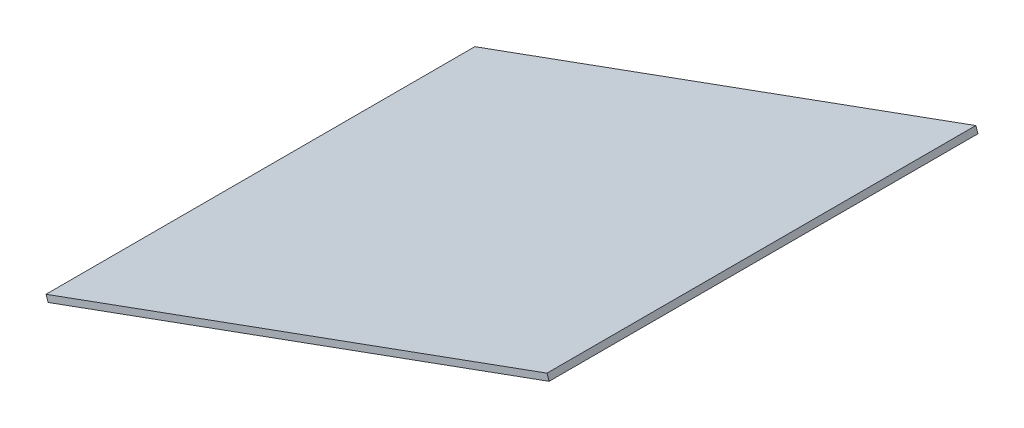
ISO-10303-21;
HEADER;
FILE_DESCRIPTION(('STEP AP214'),'2;1');
FILE_NAME('part.step','',(''),(''),'','','');
FILE_SCHEMA(('AUTOMOTIVE_DESIGN { 1 0 10303 214 1 1 1 1 }'));
ENDSEC;
DATA;
#1=APPLICATION_CONTEXT('core data for automotive mechanical design processes');
#2=APPLICATION_PROTOCOL_DEFINITION('international standard','automotive_design',2000,#1);
#3=PRODUCT_CONTEXT('',#1,'mechanical');
#4=PRODUCT('Part','Part','',(#3));
#5=PRODUCT_RELATED_PRODUCT_CATEGORY('part','',(#4));
#6=PRODUCT_DEFINITION_FORMATION('','',#4);
#7=PRODUCT_DEFINITION_CONTEXT('part definition',#1,'design');
#8=PRODUCT_DEFINITION('design','',#6,#7);
#9=PRODUCT_DEFINITION_SHAPE('','',#8);
#10=(LENGTH_UNIT() NAMED_UNIT(*) SI_UNIT(.MILLI.,.METRE.));
#11=(NAMED_UNIT(*) PLANE_ANGLE_UNIT() SI_UNIT($,.RADIAN.));
#12=(NAMED_UNIT(*) SI_UNIT($,.STERADIAN.) SOLID_ANGLE_UNIT());
#13=UNCERTAINTY_MEASURE_WITH_UNIT(LENGTH_MEASURE(1.E-05),#10,'distance_accuracy_value','');
#14=(GEOMETRIC_REPRESENTATION_CONTEXT(3) GLOBAL_UNCERTAINTY_ASSIGNED_CONTEXT((#13)) GLOBAL_UNIT_ASSIGNED_CONTEXT((#10,
#11,#12)) REPRESENTATION_CONTEXT('',''));
#15=CARTESIAN_POINT('',(0.,0.,0.));
#16=DIRECTION('',(0.,0.,1.));
#17=DIRECTION('',(1.,0.,0.));
#18=AXIS2_PLACEMENT_3D('',#15,#16,#17);
#19=CARTESIAN_POINT('',(9742.34082805623,633.915324322345,454.337600591208));
#20=DIRECTION('',(0.939787101139107,0.341760449046629,0.));
#21=DIRECTION('',(-0.341760449046629,0.939787101139108,0.));
#22=AXIS2_PLACEMENT_3D('',#19,#20,#21);
#23=PLANE('',#22);
#24=DIRECTION('',(0.341760449046629,-0.939787101139107,0.));
#25=VECTOR('',#24,1.);
#26=CARTESIAN_POINT('',(9742.34082805623,633.915324322345,202.799999999994));
#27=LINE('',#26,#25);
#28=CARTESIAN_POINT('',(9742.34082805673,633.915324322537,202.799999999994));
#29=VERTEX_POINT('',#28);
#30=CARTESIAN_POINT('',(9743.36610940387,631.095963019111,202.799999999994));
#31=VERTEX_POINT('',#30);
#32=EDGE_CURVE('E11',#29,#31,#27,.T.);
#33=ORIENTED_EDGE('',*,*,#32,.F.);
#34=DIRECTION('',(0.,0.,-1.));
#35=VECTOR('',#34,1.);
#36=CARTESIAN_POINT('',(9742.34082805623,633.915324322345,454.337600591208));
#37=LINE('',#36,#35);
#38=CARTESIAN_POINT('',(9742.34082805623,633.915324322345,1.9999999999937));
#39=VERTEX_POINT('',#38);
#40=EDGE_CURVE('E91',#29,#39,#37,.T.);
#41=ORIENTED_EDGE('',*,*,#40,.T.);
#42=DIRECTION('',(0.341760449046629,-0.939787101139107,0.));
#43=VECTOR('',#42,1.);
#44=CARTESIAN_POINT('',(9742.34082805623,633.915324322345,1.9999999999937));
#45=LINE('',#44,#43);
#46=CARTESIAN_POINT('',(9743.36610940337,631.095963018928,1.9999999999937));
#47=VERTEX_POINT('',#46);
#48=EDGE_CURVE('E82',#39,#47,#45,.T.);
#49=ORIENTED_EDGE('',*,*,#48,.T.);
#50=DIRECTION('',(0.,0.,-1.));
#51=VECTOR('',#50,1.);
#52=CARTESIAN_POINT('',(9743.36610940337,631.095963018928,454.337600591208));
#53=LINE('',#52,#51);
#54=EDGE_CURVE('E75',#31,#47,#53,.T.);
#55=ORIENTED_EDGE('',*,*,#54,.F.);
#56=EDGE_LOOP('',(#33,#41,#49,#55));
#57=FACE_BOUND('',#56,.T.);
#58=ADVANCED_FACE('F33',(#57),#23,.F.);
#59=CARTESIAN_POINT('',(9743.36610940337,631.095963018928,454.337600591208));
#60=DIRECTION('',(-0.341760449046657,0.939787101139097,0.));
#61=DIRECTION('',(-0.939787101139097,-0.341760449046657,0.));
#62=AXIS2_PLACEMENT_3D('',#59,#60,#61);
#63=PLANE('',#62);
#64=DIRECTION('',(0.939787101139097,0.341760449046657,0.));
#65=VECTOR('',#64,1.);
#66=CARTESIAN_POINT('',(9743.36610940337,631.095963018928,202.799999999994));
#67=LINE('',#66,#65);
#68=CARTESIAN_POINT('',(9977.93696984819,716.399371101157,202.799999999994));
#69=VERTEX_POINT('',#68);
#70=EDGE_CURVE('E37',#31,#69,#67,.T.);
#71=ORIENTED_EDGE('',*,*,#70,.F.);
#72=ORIENTED_EDGE('',*,*,#54,.T.);
#73=DIRECTION('',(0.939787101139097,0.341760449046657,0.));
#74=VECTOR('',#73,1.);
#75=CARTESIAN_POINT('',(9743.36610940337,631.095963018928,1.9999999999937));
#76=LINE('',#75,#74);
#77=CARTESIAN_POINT('',(9977.93696984769,716.399371100974,1.9999999999937));
#78=VERTEX_POINT('',#77);
#79=EDGE_CURVE('E78',#47,#78,#76,.T.);
#80=ORIENTED_EDGE('',*,*,#79,.T.);
#81=DIRECTION('',(0.,0.,-1.));
#82=VECTOR('',#81,1.);
#83=CARTESIAN_POINT('',(9977.93696984769,716.399371100974,454.337600591208));
#84=LINE('',#83,#82);
#85=EDGE_CURVE('E70',#69,#78,#84,.T.);
#86=ORIENTED_EDGE('',*,*,#85,.F.);
#87=EDGE_LOOP('',(#71,#72,#80,#86));
#88=FACE_BOUND('',#87,.T.);
#89=ADVANCED_FACE('F77',(#88),#63,.F.);
#90=CARTESIAN_POINT('',(9976.91168850055,719.218732404391,454.337600591208));
#91=DIRECTION('',(-0.939787101139112,-0.341760449046617,0.));
#92=DIRECTION('',(0.341760449046617,-0.939787101139112,0.));
#93=AXIS2_PLACEMENT_3D('',#90,#91,#92);
#94=PLANE('',#93);
#95=DIRECTION('',(-0.341760449046617,0.939787101139112,0.));
#96=VECTOR('',#95,1.);
#97=CARTESIAN_POINT('',(9976.91168850055,719.218732404391,202.799999999994));
#98=LINE('',#97,#96);
#99=CARTESIAN_POINT('',(9976.91168850055,719.218732404391,202.799999999994));
#100=VERTEX_POINT('',#99);
#101=EDGE_CURVE('E105',#69,#100,#98,.T.);
#102=ORIENTED_EDGE('',*,*,#101,.F.);
#103=ORIENTED_EDGE('',*,*,#85,.T.);
#104=DIRECTION('',(-0.341760449046617,0.939787101139112,0.));
#105=VECTOR('',#104,1.);
#106=CARTESIAN_POINT('',(9976.91168850055,719.218732404391,1.9999999999937));
#107=LINE('',#106,#105);
#108=CARTESIAN_POINT('',(9976.91168850055,719.218732404391,1.9999999999937));
#109=VERTEX_POINT('',#108);
#110=EDGE_CURVE('E88',#78,#109,#107,.T.);
#111=ORIENTED_EDGE('',*,*,#110,.T.);
#112=DIRECTION('',(0.,0.,-1.));
#113=VECTOR('',#112,1.);
#114=CARTESIAN_POINT('',(9976.91168850055,719.218732404391,454.337600591208));
#115=LINE('',#114,#113);
#116=EDGE_CURVE('E97',#100,#109,#115,.T.);
#117=ORIENTED_EDGE('',*,*,#116,.F.);
#118=EDGE_LOOP('',(#102,#103,#111,#117));
#119=FACE_BOUND('',#118,.T.);
#120=ADVANCED_FACE('F106',(#119),#94,.F.);
#121=CARTESIAN_POINT('',(9742.34082805623,633.915324322345,454.337600591208));
#122=DIRECTION('',(0.341760449046657,-0.939787101139097,0.));
#123=DIRECTION('',(0.939787101139097,0.341760449046657,0.));
#124=AXIS2_PLACEMENT_3D('',#121,#122,#123);
#125=PLANE('',#124);
#126=DIRECTION('',(-0.939787101139097,-0.341760449046657,0.));
#127=VECTOR('',#126,1.);
#128=CARTESIAN_POINT('',(9742.34082805623,633.915324322345,202.799999999994));
#129=LINE('',#128,#127);
#130=EDGE_CURVE('E43',#100,#29,#129,.T.);
#131=ORIENTED_EDGE('',*,*,#130,.F.);
#132=ORIENTED_EDGE('',*,*,#116,.T.);
#133=DIRECTION('',(-0.939787101139097,-0.341760449046657,0.));
#134=VECTOR('',#133,1.);
#135=CARTESIAN_POINT('',(9742.34082805623,633.915324322345,1.9999999999937));
#136=LINE('',#135,#134);
#137=EDGE_CURVE('E98',#109,#39,#136,.T.);
#138=ORIENTED_EDGE('',*,*,#137,.T.);
#139=ORIENTED_EDGE('',*,*,#40,.F.);
#140=EDGE_LOOP('',(#131,#132,#138,#139));
#141=FACE_BOUND('',#140,.T.);
#142=ADVANCED_FACE('F107',(#141),#125,.F.);
#143=CARTESIAN_POINT('',(0.,0.,1.9999999999937));
#144=DIRECTION('',(0.,0.,1.));
#145=DIRECTION('',(1.,0.,0.));
#146=AXIS2_PLACEMENT_3D('',#143,#144,#145);
#147=PLANE('',#146);
#148=ORIENTED_EDGE('',*,*,#48,.F.);
#149=ORIENTED_EDGE('',*,*,#137,.F.);
#150=ORIENTED_EDGE('',*,*,#110,.F.);
#151=ORIENTED_EDGE('',*,*,#79,.F.);
#152=EDGE_LOOP('',(#148,#149,#150,#151));
#153=FACE_BOUND('',#152,.T.);
#154=ADVANCED_FACE('F86',(#153),#147,.F.);
#155=CARTESIAN_POINT('',(9742.34082805673,633.915324322537,202.799999999994));
#156=DIRECTION('',(0.,0.,1.));
#157=DIRECTION('',(0.939787101139094,0.341760449046664,0.));
#158=AXIS2_PLACEMENT_3D('',#155,#156,#157);
#159=PLANE('',#158);
#160=ORIENTED_EDGE('',*,*,#70,.T.);
#161=ORIENTED_EDGE('',*,*,#101,.T.);
#162=ORIENTED_EDGE('',*,*,#130,.T.);
#163=ORIENTED_EDGE('',*,*,#32,.T.);
#164=EDGE_LOOP('',(#160,#161,#162,#163));
#165=FACE_BOUND('',#164,.T.);
#166=ADVANCED_FACE('F35',(#165),#159,.T.);
#167=CLOSED_SHELL('',(#58,#89,#120,#142,#154,#166));
#168=MANIFOLD_SOLID_BREP('B2',#167);
#169=ADVANCED_BREP_SHAPE_REPRESENTATION('',(#18,#168),#14);
#170=SHAPE_DEFINITION_REPRESENTATION(#9,#169);
ENDSEC;
END-ISO-10303-21;
